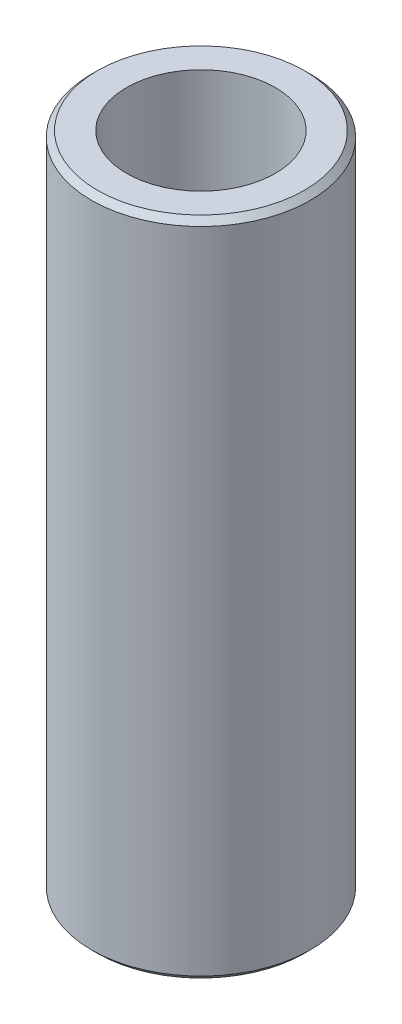
ISO-10303-21;
HEADER;
FILE_DESCRIPTION(('STEP AP214'),'2;1');
FILE_NAME('part.step','',(''),(''),'','','');
FILE_SCHEMA(('AUTOMOTIVE_DESIGN { 1 0 10303 214 1 1 1 1 }'));
ENDSEC;
DATA;
#1=APPLICATION_CONTEXT('core data for automotive mechanical design processes');
#2=APPLICATION_PROTOCOL_DEFINITION('international standard','automotive_design',2000,#1);
#3=PRODUCT_CONTEXT('',#1,'mechanical');
#4=PRODUCT('Part','Part','',(#3));
#5=PRODUCT_RELATED_PRODUCT_CATEGORY('part','',(#4));
#6=PRODUCT_DEFINITION_FORMATION('','',#4);
#7=PRODUCT_DEFINITION_CONTEXT('part definition',#1,'design');
#8=PRODUCT_DEFINITION('design','',#6,#7);
#9=PRODUCT_DEFINITION_SHAPE('','',#8);
#10=(LENGTH_UNIT() NAMED_UNIT(*) SI_UNIT(.MILLI.,.METRE.));
#11=(NAMED_UNIT(*) PLANE_ANGLE_UNIT() SI_UNIT($,.RADIAN.));
#12=(NAMED_UNIT(*) SI_UNIT($,.STERADIAN.) SOLID_ANGLE_UNIT());
#13=UNCERTAINTY_MEASURE_WITH_UNIT(LENGTH_MEASURE(1.E-05),#10,'distance_accuracy_value','');
#14=(GEOMETRIC_REPRESENTATION_CONTEXT(3) GLOBAL_UNCERTAINTY_ASSIGNED_CONTEXT((#13)) GLOBAL_UNIT_ASSIGNED_CONTEXT((#10,
#11,#12)) REPRESENTATION_CONTEXT('',''));
#15=CARTESIAN_POINT('',(0.,0.,0.));
#16=DIRECTION('',(0.,0.,1.));
#17=DIRECTION('',(1.,0.,0.));
#18=AXIS2_PLACEMENT_3D('',#15,#16,#17);
#19=CARTESIAN_POINT('',(0.,14.381250003,0.));
#20=DIRECTION('',(0.,-1.,0.));
#21=DIRECTION('',(0.,0.,-1.));
#22=AXIS2_PLACEMENT_3D('',#19,#20,#21);
#23=CYLINDRICAL_SURFACE('',#22,4.7625);
#24=CARTESIAN_POINT('',(0.,14.127250003,0.));
#25=DIRECTION('',(0.,1.,0.));
#26=DIRECTION('',(0.,0.,1.));
#27=AXIS2_PLACEMENT_3D('',#24,#25,#26);
#28=CIRCLE('',#27,4.7625);
#29=CARTESIAN_POINT('',(0.,14.127250003,4.7625));
#30=VERTEX_POINT('',#29);
#31=EDGE_CURVE('E43',#30,#30,#28,.F.);
#32=ORIENTED_EDGE('',*,*,#31,.T.);
#33=EDGE_LOOP('',(#32));
#34=FACE_BOUND('',#33,.T.);
#35=CARTESIAN_POINT('',(0.,-14.127250003,0.));
#36=DIRECTION('',(0.,1.,0.));
#37=DIRECTION('',(0.,0.,1.));
#38=AXIS2_PLACEMENT_3D('',#35,#36,#37);
#39=CIRCLE('',#38,4.7625);
#40=CARTESIAN_POINT('',(0.,-14.127250003,4.7625));
#41=VERTEX_POINT('',#40);
#42=EDGE_CURVE('E47',#41,#41,#39,.T.);
#43=ORIENTED_EDGE('',*,*,#42,.T.);
#44=EDGE_LOOP('',(#43));
#45=FACE_BOUND('',#44,.T.);
#46=ADVANCED_FACE('F35',(#34,#45),#23,.T.);
#47=CARTESIAN_POINT('',(0.,14.381250003,0.));
#48=DIRECTION('',(0.,1.,0.));
#49=DIRECTION('',(0.,0.,1.));
#50=AXIS2_PLACEMENT_3D('',#47,#48,#49);
#51=PLANE('',#50);
#52=CARTESIAN_POINT('',(0.,14.381250003,0.));
#53=DIRECTION('',(0.,-1.,0.));
#54=DIRECTION('',(0.,0.,-1.));
#55=AXIS2_PLACEMENT_3D('',#52,#53,#54);
#56=CIRCLE('',#55,3.2385);
#57=CARTESIAN_POINT('',(0.,14.381250003,-3.2385));
#58=VERTEX_POINT('',#57);
#59=EDGE_CURVE('E56',#58,#58,#56,.T.);
#60=ORIENTED_EDGE('',*,*,#59,.T.);
#61=EDGE_LOOP('',(#60));
#62=FACE_BOUND('',#61,.T.);
#63=CARTESIAN_POINT('',(0.,14.381250003,0.));
#64=DIRECTION('',(0.,1.,0.));
#65=DIRECTION('',(0.,0.,1.));
#66=AXIS2_PLACEMENT_3D('',#63,#64,#65);
#67=CIRCLE('',#66,4.50850000000001);
#68=CARTESIAN_POINT('',(0.,14.381250003,4.50850000000001));
#69=VERTEX_POINT('',#68);
#70=EDGE_CURVE('E51',#69,#69,#67,.T.);
#71=ORIENTED_EDGE('',*,*,#70,.T.);
#72=EDGE_LOOP('',(#71));
#73=FACE_BOUND('',#72,.T.);
#74=ADVANCED_FACE('F63',(#62,#73),#51,.T.);
#75=CARTESIAN_POINT('',(0.,-14.381250003,0.));
#76=DIRECTION('',(0.,1.,0.));
#77=DIRECTION('',(0.,0.,1.));
#78=AXIS2_PLACEMENT_3D('',#75,#76,#77);
#79=PLANE('',#78);
#80=CARTESIAN_POINT('',(0.,-14.381250003,0.));
#81=DIRECTION('',(0.,-1.,0.));
#82=DIRECTION('',(0.,0.,-1.));
#83=AXIS2_PLACEMENT_3D('',#80,#81,#82);
#84=CIRCLE('',#83,3.2385);
#85=CARTESIAN_POINT('',(0.,-14.381250003,-3.2385));
#86=VERTEX_POINT('',#85);
#87=EDGE_CURVE('E57',#86,#86,#84,.T.);
#88=ORIENTED_EDGE('',*,*,#87,.F.);
#89=EDGE_LOOP('',(#88));
#90=FACE_BOUND('',#89,.T.);
#91=CARTESIAN_POINT('',(0.,-14.381250003,0.));
#92=DIRECTION('',(0.,1.,0.));
#93=DIRECTION('',(0.,0.,1.));
#94=AXIS2_PLACEMENT_3D('',#91,#92,#93);
#95=CIRCLE('',#94,4.50849999999997);
#96=CARTESIAN_POINT('',(0.,-14.381250003,4.50849999999997));
#97=VERTEX_POINT('',#96);
#98=EDGE_CURVE('E10',#97,#97,#95,.F.);
#99=ORIENTED_EDGE('',*,*,#98,.T.);
#100=EDGE_LOOP('',(#99));
#101=FACE_BOUND('',#100,.T.);
#102=ADVANCED_FACE('F72',(#90,#101),#79,.F.);
#103=CARTESIAN_POINT('',(0.,14.381250003,0.));
#104=DIRECTION('',(0.,-1.,0.));
#105=DIRECTION('',(0.,0.,-1.));
#106=AXIS2_PLACEMENT_3D('',#103,#104,#105);
#107=CONICAL_SURFACE('',#106,4.50850000000001,0.785398163397445);
#108=ORIENTED_EDGE('',*,*,#31,.F.);
#109=EDGE_LOOP('',(#108));
#110=FACE_BOUND('',#109,.T.);
#111=ORIENTED_EDGE('',*,*,#70,.F.);
#112=EDGE_LOOP('',(#111));
#113=FACE_BOUND('',#112,.T.);
#114=ADVANCED_FACE('F74',(#110,#113),#107,.T.);
#115=CARTESIAN_POINT('',(0.,-14.127250003,0.));
#116=DIRECTION('',(0.,1.,0.));
#117=DIRECTION('',(0.,0.,1.));
#118=AXIS2_PLACEMENT_3D('',#115,#116,#117);
#119=CONICAL_SURFACE('',#118,4.7625,0.785398163397452);
#120=ORIENTED_EDGE('',*,*,#98,.F.);
#121=EDGE_LOOP('',(#120));
#122=FACE_BOUND('',#121,.T.);
#123=ORIENTED_EDGE('',*,*,#42,.F.);
#124=EDGE_LOOP('',(#123));
#125=FACE_BOUND('',#124,.T.);
#126=ADVANCED_FACE('F38',(#122,#125),#119,.T.);
#127=CARTESIAN_POINT('',(0.,14.381250003,0.));
#128=DIRECTION('',(0.,-1.,0.));
#129=DIRECTION('',(0.,0.,-1.));
#130=AXIS2_PLACEMENT_3D('',#127,#128,#129);
#131=CYLINDRICAL_SURFACE('',#130,3.2385);
#132=ORIENTED_EDGE('',*,*,#59,.F.);
#133=EDGE_LOOP('',(#132));
#134=FACE_BOUND('',#133,.T.);
#135=ORIENTED_EDGE('',*,*,#87,.T.);
#136=EDGE_LOOP('',(#135));
#137=FACE_BOUND('',#136,.T.);
#138=ADVANCED_FACE('F66',(#134,#137),#131,.F.);
#139=CLOSED_SHELL('',(#46,#74,#102,#114,#126,#138));
#140=MANIFOLD_SOLID_BREP('B2',#139);
#141=ADVANCED_BREP_SHAPE_REPRESENTATION('',(#18,#140),#14);
#142=SHAPE_DEFINITION_REPRESENTATION(#9,#141);
ENDSEC;
END-ISO-10303-21;
